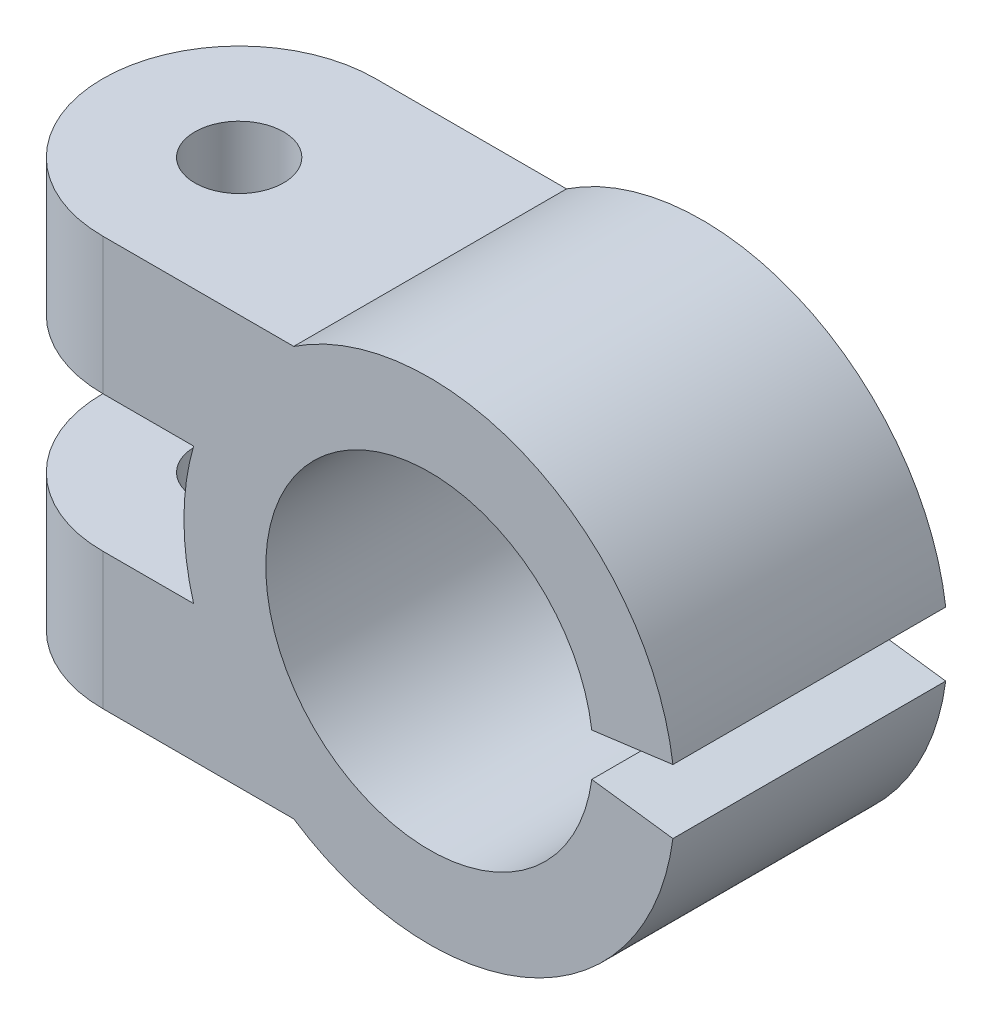
ISO-10303-21;
HEADER;
FILE_DESCRIPTION(('STEP AP214'),'2;1');
FILE_NAME('part.step','',(''),(''),'','','');
FILE_SCHEMA(('AUTOMOTIVE_DESIGN { 1 0 10303 214 1 1 1 1 }'));
ENDSEC;
DATA;
#1=APPLICATION_CONTEXT('core data for automotive mechanical design processes');
#2=APPLICATION_PROTOCOL_DEFINITION('international standard','automotive_design',2000,#1);
#3=PRODUCT_CONTEXT('',#1,'mechanical');
#4=PRODUCT('Part','Part','',(#3));
#5=PRODUCT_RELATED_PRODUCT_CATEGORY('part','',(#4));
#6=PRODUCT_DEFINITION_FORMATION('','',#4);
#7=PRODUCT_DEFINITION_CONTEXT('part definition',#1,'design');
#8=PRODUCT_DEFINITION('design','',#6,#7);
#9=PRODUCT_DEFINITION_SHAPE('','',#8);
#10=(LENGTH_UNIT() NAMED_UNIT(*) SI_UNIT(.MILLI.,.METRE.));
#11=(NAMED_UNIT(*) PLANE_ANGLE_UNIT() SI_UNIT($,.RADIAN.));
#12=(NAMED_UNIT(*) SI_UNIT($,.STERADIAN.) SOLID_ANGLE_UNIT());
#13=UNCERTAINTY_MEASURE_WITH_UNIT(LENGTH_MEASURE(1.E-05),#10,'distance_accuracy_value','');
#14=(GEOMETRIC_REPRESENTATION_CONTEXT(3) GLOBAL_UNCERTAINTY_ASSIGNED_CONTEXT((#13)) GLOBAL_UNIT_ASSIGNED_CONTEXT((#10,
#11,#12)) REPRESENTATION_CONTEXT('',''));
#15=CARTESIAN_POINT('',(0.,0.,0.));
#16=DIRECTION('',(0.,0.,1.));
#17=DIRECTION('',(1.,0.,0.));
#18=AXIS2_PLACEMENT_3D('',#15,#16,#17);
#19=CARTESIAN_POINT('',(-11.9749371855331,9.,5.));
#20=DIRECTION('',(0.,-1.,0.));
#21=DIRECTION('',(1.,0.,0.));
#22=AXIS2_PLACEMENT_3D('',#19,#20,#21);
#23=CYLINDRICAL_SURFACE('',#22,1.625);
#24=CARTESIAN_POINT('',(-11.9749371855331,-2.5,5.));
#25=DIRECTION('',(0.,-1.,0.));
#26=DIRECTION('',(1.,0.,0.));
#27=AXIS2_PLACEMENT_3D('',#24,#25,#26);
#28=CIRCLE('',#27,1.625);
#29=CARTESIAN_POINT('',(-10.3499371855331,-2.5,5.));
#30=VERTEX_POINT('',#29);
#31=EDGE_CURVE('E268',#30,#30,#28,.F.);
#32=ORIENTED_EDGE('',*,*,#31,.T.);
#33=EDGE_LOOP('',(#32));
#34=FACE_BOUND('',#33,.T.);
#35=CARTESIAN_POINT('',(-11.9749371855331,-5.2,5.));
#36=DIRECTION('',(0.,-1.,0.));
#37=DIRECTION('',(0.,0.,-1.));
#38=AXIS2_PLACEMENT_3D('',#35,#36,#37);
#39=CIRCLE('',#38,1.625);
#40=CARTESIAN_POINT('',(-11.9749371855331,-5.2,3.375));
#41=VERTEX_POINT('',#40);
#42=EDGE_CURVE('E36',#41,#41,#39,.F.);
#43=ORIENTED_EDGE('',*,*,#42,.F.);
#44=EDGE_LOOP('',(#43));
#45=FACE_BOUND('',#44,.T.);
#46=ADVANCED_FACE('F32',(#34,#45),#23,.F.);
#47=CARTESIAN_POINT('',(0.,0.,0.));
#48=DIRECTION('',(0.,0.,1.));
#49=DIRECTION('',(1.,0.,0.));
#50=AXIS2_PLACEMENT_3D('',#47,#48,#49);
#51=CYLINDRICAL_SURFACE('',#50,9.);
#52=DIRECTION('',(0.,0.,1.));
#53=VECTOR('',#52,1.);
#54=CARTESIAN_POINT('',(-8.64580823289529,-2.5,0.));
#55=LINE('',#54,#53);
#56=CARTESIAN_POINT('',(-8.64580823289529,-2.5,0.));
#57=VERTEX_POINT('',#56);
#58=CARTESIAN_POINT('',(-8.64580823289529,-2.5,0.621998125090777));
#59=VERTEX_POINT('',#58);
#60=EDGE_CURVE('E256',#57,#59,#55,.T.);
#61=ORIENTED_EDGE('',*,*,#60,.T.);
#62=CARTESIAN_POINT('',(-8.64580823289529,-2.5,0.621998125090777));
#63=CARTESIAN_POINT('',(-8.67828126991192,-2.38771961929906,0.597318032627893));
#64=CARTESIAN_POINT('',(-8.70867702053455,-2.27438318593473,0.574761575041442));
#65=CARTESIAN_POINT('',(-8.7651540966611,-2.04594389616501,0.533620812518907));
#66=CARTESIAN_POINT('',(-8.79123601155127,-1.9308412834195,0.515035964852341));
#67=CARTESIAN_POINT('',(-8.83892333773925,-1.69923878673797,0.481564563287811));
#68=CARTESIAN_POINT('',(-8.8605308440495,-1.58273958386935,0.466676277928622));
#69=CARTESIAN_POINT('',(-8.89917693862374,-1.3486047279511,0.440368338495543));
#70=CARTESIAN_POINT('',(-8.91621540136065,-1.23096904377044,0.428948779718157));
#71=CARTESIAN_POINT('',(-8.95942317453489,-0.884197201140675,0.400229112206679));
#72=CARTESIAN_POINT('',(-8.97919343570807,-0.65384365693981,0.387441823289321));
#73=CARTESIAN_POINT('',(-9.00092271419665,-0.191983296734021,0.373403086047597));
#74=CARTESIAN_POINT('',(-9.00288204570967,0.0395234988546319,0.372151434226273));
#75=CARTESIAN_POINT('',(-8.99029346010361,0.458014703977985,0.380267757993741));
#76=CARTESIAN_POINT('',(-8.97879867269678,0.645135321875428,0.387671243383126));
#77=CARTESIAN_POINT('',(-8.94422422859518,1.01776878967844,0.410314772750872));
#78=CARTESIAN_POINT('',(-8.92114837491746,1.20328214704967,0.425552244227041));
#79=CARTESIAN_POINT('',(-8.86291201950286,1.57650537074293,0.464961538287904));
#80=CARTESIAN_POINT('',(-8.8274511891554,1.76414575210169,0.489356645384948));
#81=CARTESIAN_POINT('',(-8.76567120377647,2.04256386354546,0.53331862036557));
#82=CARTESIAN_POINT('',(-8.74363514381309,2.13490170018891,0.549209213692224));
#83=CARTESIAN_POINT('',(-8.69678428913928,2.31838584986829,0.583604287340637));
#84=CARTESIAN_POINT('',(-8.67196925681976,2.409532060272,0.602108991210794));
#85=CARTESIAN_POINT('',(-8.64580823289529,2.5,0.621998125090779));
#86=B_SPLINE_CURVE_WITH_KNOTS('',3,(#62,#63,#64,#65,#66,#67,#68,#69,#70,#71,#72,#73,#74,#75,#76,
#77,#78,#79,#80,#81,#82,#83,#84,#85),.UNSPECIFIED.,.F.,.F.,(4,2,2,2,2,2,2,2,2,2,2,4),(0.,
0.358319681642908,0.716590366644925,1.07469292055495,1.43280531174513,2.12639692959824,
2.81997631197154,3.38232626265192,3.94449166828021,4.52136260131052,4.81004533632213,
5.09875277330095),.UNSPECIFIED.);
#87=CARTESIAN_POINT('',(-8.64580823289529,2.5,0.621998125090777));
#88=VERTEX_POINT('',#87);
#89=EDGE_CURVE('E11',#59,#88,#86,.T.);
#90=ORIENTED_EDGE('',*,*,#89,.T.);
#91=DIRECTION('',(0.,0.,1.));
#92=VECTOR('',#91,1.);
#93=CARTESIAN_POINT('',(-8.64580823289529,2.5,0.));
#94=LINE('',#93,#92);
#95=CARTESIAN_POINT('',(-8.64580823289529,2.5,0.));
#96=VERTEX_POINT('',#95);
#97=EDGE_CURVE('E261',#96,#88,#94,.T.);
#98=ORIENTED_EDGE('',*,*,#97,.F.);
#99=CARTESIAN_POINT('',(0.,0.,0.));
#100=DIRECTION('',(0.,0.,-1.));
#101=DIRECTION('',(1.,0.,0.));
#102=AXIS2_PLACEMENT_3D('',#99,#100,#101);
#103=CIRCLE('',#102,9.);
#104=EDGE_CURVE('E242',#57,#96,#103,.T.);
#105=ORIENTED_EDGE('',*,*,#104,.F.);
#106=EDGE_LOOP('',(#61,#90,#98,#105));
#107=FACE_BOUND('',#106,.T.);
#108=ADVANCED_FACE('F381',(#107),#51,.T.);
#109=CARTESIAN_POINT('',(-11.9749371855331,0.,5.));
#110=DIRECTION('',(0.,-1.,0.));
#111=DIRECTION('',(1.,0.,0.));
#112=AXIS2_PLACEMENT_3D('',#109,#110,#111);
#113=CYLINDRICAL_SURFACE('',#112,5.);
#114=CARTESIAN_POINT('',(-11.9749371855331,-2.5,5.));
#115=DIRECTION('',(0.,-1.,0.));
#116=DIRECTION('',(1.,0.,0.));
#117=AXIS2_PLACEMENT_3D('',#114,#115,#116);
#118=CIRCLE('',#117,5.);
#119=CARTESIAN_POINT('',(-16.9749371855331,-2.5,4.99999999999999));
#120=VERTEX_POINT('',#119);
#121=CARTESIAN_POINT('',(-11.9749371855331,-2.5,10.));
#122=VERTEX_POINT('',#121);
#123=EDGE_CURVE('E271',#120,#122,#118,.F.);
#124=ORIENTED_EDGE('',*,*,#123,.F.);
#125=DIRECTION('',(0.,-1.,0.));
#126=VECTOR('',#125,1.);
#127=CARTESIAN_POINT('',(-16.9749371855331,7.5,5.));
#128=LINE('',#127,#126);
#129=CARTESIAN_POINT('',(-16.9749371855331,-7.5,4.99999999999999));
#130=VERTEX_POINT('',#129);
#131=EDGE_CURVE('E283',#130,#120,#128,.F.);
#132=ORIENTED_EDGE('',*,*,#131,.F.);
#133=CARTESIAN_POINT('',(-11.9749371855331,-7.5,5.));
#134=DIRECTION('',(0.,-1.,0.));
#135=DIRECTION('',(1.,0.,0.));
#136=AXIS2_PLACEMENT_3D('',#133,#134,#135);
#137=CIRCLE('',#136,5.);
#138=CARTESIAN_POINT('',(-11.9749371855331,-7.5,10.));
#139=VERTEX_POINT('',#138);
#140=EDGE_CURVE('E333',#139,#130,#137,.T.);
#141=ORIENTED_EDGE('',*,*,#140,.F.);
#142=DIRECTION('',(0.,-1.,0.));
#143=VECTOR('',#142,1.);
#144=CARTESIAN_POINT('',(-11.9749371855331,0.,10.));
#145=LINE('',#144,#143);
#146=EDGE_CURVE('E337',#122,#139,#145,.T.);
#147=ORIENTED_EDGE('',*,*,#146,.F.);
#148=EDGE_LOOP('',(#124,#132,#141,#147));
#149=FACE_BOUND('',#148,.T.);
#150=ADVANCED_FACE('F388',(#149),#113,.T.);
#151=CARTESIAN_POINT('',(-11.9749371855331,0.,5.));
#152=DIRECTION('',(0.,-1.,0.));
#153=DIRECTION('',(1.,0.,0.));
#154=AXIS2_PLACEMENT_3D('',#151,#152,#153);
#155=CYLINDRICAL_SURFACE('',#154,5.);
#156=CARTESIAN_POINT('',(-11.9749371855331,-2.5,5.));
#157=DIRECTION('',(0.,-1.,0.));
#158=DIRECTION('',(1.,0.,0.));
#159=AXIS2_PLACEMENT_3D('',#156,#157,#158);
#160=CIRCLE('',#159,5.);
#161=CARTESIAN_POINT('',(-11.9749371855331,-2.5,0.));
#162=VERTEX_POINT('',#161);
#163=EDGE_CURVE('E269',#162,#120,#160,.F.);
#164=ORIENTED_EDGE('',*,*,#163,.F.);
#165=DIRECTION('',(0.,1.,0.));
#166=VECTOR('',#165,1.);
#167=CARTESIAN_POINT('',(-11.9749371855331,7.5,0.));
#168=LINE('',#167,#166);
#169=CARTESIAN_POINT('',(-11.9749371855331,-7.5,0.));
#170=VERTEX_POINT('',#169);
#171=EDGE_CURVE('E325',#170,#162,#168,.T.);
#172=ORIENTED_EDGE('',*,*,#171,.F.);
#173=CARTESIAN_POINT('',(-11.9749371855331,-7.5,5.));
#174=DIRECTION('',(0.,-1.,0.));
#175=DIRECTION('',(1.,0.,0.));
#176=AXIS2_PLACEMENT_3D('',#173,#174,#175);
#177=CIRCLE('',#176,5.);
#178=EDGE_CURVE('E335',#130,#170,#177,.T.);
#179=ORIENTED_EDGE('',*,*,#178,.F.);
#180=ORIENTED_EDGE('',*,*,#131,.T.);
#181=EDGE_LOOP('',(#164,#172,#179,#180));
#182=FACE_BOUND('',#181,.T.);
#183=ADVANCED_FACE('F399',(#182),#155,.T.);
#184=CARTESIAN_POINT('',(0.,0.,10.));
#185=DIRECTION('',(0.,0.,-1.));
#186=DIRECTION('',(-1.,0.,0.));
#187=AXIS2_PLACEMENT_3D('',#184,#185,#186);
#188=CYLINDRICAL_SURFACE('',#187,9.);
#189=CARTESIAN_POINT('',(0.,0.,10.));
#190=DIRECTION('',(0.,0.,1.));
#191=DIRECTION('',(1.,0.,0.));
#192=AXIS2_PLACEMENT_3D('',#189,#190,#191);
#193=CIRCLE('',#192,9.);
#194=CARTESIAN_POINT('',(-4.97493718553311,-7.5,10.));
#195=VERTEX_POINT('',#194);
#196=CARTESIAN_POINT('',(8.92300375236431,-1.1747357299804,10.));
#197=VERTEX_POINT('',#196);
#198=EDGE_CURVE('E317',#195,#197,#193,.T.);
#199=ORIENTED_EDGE('',*,*,#198,.F.);
#200=DIRECTION('',(0.,0.,1.));
#201=VECTOR('',#200,1.);
#202=CARTESIAN_POINT('',(-4.97493718553311,-7.5,-19.2093727122985));
#203=LINE('',#202,#201);
#204=CARTESIAN_POINT('',(-4.97493718553311,-7.5,0.));
#205=VERTEX_POINT('',#204);
#206=EDGE_CURVE('E278',#205,#195,#203,.T.);
#207=ORIENTED_EDGE('',*,*,#206,.F.);
#208=CARTESIAN_POINT('',(0.,0.,0.));
#209=DIRECTION('',(0.,0.,1.));
#210=DIRECTION('',(1.,0.,0.));
#211=AXIS2_PLACEMENT_3D('',#208,#209,#210);
#212=CIRCLE('',#211,9.);
#213=CARTESIAN_POINT('',(8.92300375236431,-1.1747357299804,0.));
#214=VERTEX_POINT('',#213);
#215=EDGE_CURVE('E310',#205,#214,#212,.T.);
#216=ORIENTED_EDGE('',*,*,#215,.T.);
#217=DIRECTION('',(0.,0.,1.));
#218=VECTOR('',#217,1.);
#219=CARTESIAN_POINT('',(8.92300375236431,-1.1747357299804,0.));
#220=LINE('',#219,#218);
#221=EDGE_CURVE('E298',#214,#197,#220,.T.);
#222=ORIENTED_EDGE('',*,*,#221,.T.);
#223=EDGE_LOOP('',(#199,#207,#216,#222));
#224=FACE_BOUND('',#223,.T.);
#225=ADVANCED_FACE('F441',(#224),#188,.T.);
#226=CARTESIAN_POINT('',(0.,0.,10.));
#227=DIRECTION('',(0.,0.,1.));
#228=DIRECTION('',(1.,0.,0.));
#229=AXIS2_PLACEMENT_3D('',#226,#227,#228);
#230=PLANE('',#229);
#231=DIRECTION('',(1.,0.,0.));
#232=VECTOR('',#231,1.);
#233=CARTESIAN_POINT('',(-8.64580823289529,-2.5,10.));
#234=LINE('',#233,#232);
#235=CARTESIAN_POINT('',(-8.64580823289529,-2.5,10.));
#236=VERTEX_POINT('',#235);
#237=EDGE_CURVE('E246',#122,#236,#234,.T.);
#238=ORIENTED_EDGE('',*,*,#237,.F.);
#239=ORIENTED_EDGE('',*,*,#146,.T.);
#240=DIRECTION('',(1.,0.,0.));
#241=VECTOR('',#240,1.);
#242=CARTESIAN_POINT('',(-4.97493718553311,-7.5,10.));
#243=LINE('',#242,#241);
#244=EDGE_CURVE('E282',#139,#195,#243,.T.);
#245=ORIENTED_EDGE('',*,*,#244,.T.);
#246=ORIENTED_EDGE('',*,*,#198,.T.);
#247=DIRECTION('',(0.991444861373811,-0.130526192220044,0.));
#248=VECTOR('',#247,1.);
#249=CARTESIAN_POINT('',(8.92300375236431,-1.1747357299804,10.));
#250=LINE('',#249,#248);
#251=CARTESIAN_POINT('',(5.94866916824287,-0.783157153320264,10.));
#252=VERTEX_POINT('',#251);
#253=EDGE_CURVE('E290',#252,#197,#250,.T.);
#254=ORIENTED_EDGE('',*,*,#253,.F.);
#255=CARTESIAN_POINT('',(0.,0.,10.));
#256=DIRECTION('',(0.,0.,1.));
#257=DIRECTION('',(1.,0.,0.));
#258=AXIS2_PLACEMENT_3D('',#255,#256,#257);
#259=CIRCLE('',#258,6.);
#260=CARTESIAN_POINT('',(5.94866916824286,0.783157153320315,10.));
#261=VERTEX_POINT('',#260);
#262=EDGE_CURVE('E307',#261,#252,#259,.T.);
#263=ORIENTED_EDGE('',*,*,#262,.F.);
#264=DIRECTION('',(-0.99144486137381,-0.130526192220053,0.));
#265=VECTOR('',#264,1.);
#266=CARTESIAN_POINT('',(0.,0.,10.));
#267=LINE('',#266,#265);
#268=CARTESIAN_POINT('',(8.92300375236429,1.17473572998047,10.));
#269=VERTEX_POINT('',#268);
#270=EDGE_CURVE('E295',#269,#261,#267,.T.);
#271=ORIENTED_EDGE('',*,*,#270,.F.);
#272=CARTESIAN_POINT('',(-4.9749371855331,7.5,10.));
#273=VERTEX_POINT('',#272);
#274=EDGE_CURVE('E313',#269,#273,#193,.T.);
#275=ORIENTED_EDGE('',*,*,#274,.T.);
#276=DIRECTION('',(-1.,0.,0.));
#277=VECTOR('',#276,1.);
#278=CARTESIAN_POINT('',(-4.97493718553311,7.5,10.));
#279=LINE('',#278,#277);
#280=CARTESIAN_POINT('',(-11.9749371855331,7.5,10.));
#281=VERTEX_POINT('',#280);
#282=EDGE_CURVE('E279',#273,#281,#279,.T.);
#283=ORIENTED_EDGE('',*,*,#282,.T.);
#284=CARTESIAN_POINT('',(-11.9749371855331,2.5,10.));
#285=VERTEX_POINT('',#284);
#286=EDGE_CURVE('E338',#281,#285,#145,.T.);
#287=ORIENTED_EDGE('',*,*,#286,.T.);
#288=DIRECTION('',(-1.,0.,0.));
#289=VECTOR('',#288,1.);
#290=CARTESIAN_POINT('',(-8.64580823289529,2.5,10.));
#291=LINE('',#290,#289);
#292=CARTESIAN_POINT('',(-8.64580823289529,2.5,10.));
#293=VERTEX_POINT('',#292);
#294=EDGE_CURVE('E253',#293,#285,#291,.T.);
#295=ORIENTED_EDGE('',*,*,#294,.F.);
#296=CARTESIAN_POINT('',(0.,0.,10.));
#297=DIRECTION('',(0.,0.,-1.));
#298=DIRECTION('',(1.,0.,0.));
#299=AXIS2_PLACEMENT_3D('',#296,#297,#298);
#300=CIRCLE('',#299,9.);
#301=EDGE_CURVE('E240',#236,#293,#300,.T.);
#302=ORIENTED_EDGE('',*,*,#301,.F.);
#303=EDGE_LOOP('',(#238,#239,#245,#246,#254,#263,#271,#275,#283,#287,#295,#302));
#304=FACE_BOUND('',#303,.T.);
#305=ADVANCED_FACE('F429',(#304),#230,.T.);
#306=CARTESIAN_POINT('',(0.,0.,0.));
#307=DIRECTION('',(0.,0.,1.));
#308=DIRECTION('',(1.,0.,0.));
#309=AXIS2_PLACEMENT_3D('',#306,#307,#308);
#310=PLANE('',#309);
#311=ORIENTED_EDGE('',*,*,#171,.T.);
#312=DIRECTION('',(1.,0.,0.));
#313=VECTOR('',#312,1.);
#314=CARTESIAN_POINT('',(-8.64580823289529,-2.5,0.));
#315=LINE('',#314,#313);
#316=EDGE_CURVE('E248',#162,#57,#315,.T.);
#317=ORIENTED_EDGE('',*,*,#316,.T.);
#318=ORIENTED_EDGE('',*,*,#104,.T.);
#319=DIRECTION('',(-1.,0.,0.));
#320=VECTOR('',#319,1.);
#321=CARTESIAN_POINT('',(-8.64580823289529,2.5,0.));
#322=LINE('',#321,#320);
#323=CARTESIAN_POINT('',(-11.9749371855331,2.5,0.));
#324=VERTEX_POINT('',#323);
#325=EDGE_CURVE('E245',#96,#324,#322,.T.);
#326=ORIENTED_EDGE('',*,*,#325,.T.);
#327=CARTESIAN_POINT('',(-11.9749371855331,7.5,0.));
#328=VERTEX_POINT('',#327);
#329=EDGE_CURVE('E324',#324,#328,#168,.T.);
#330=ORIENTED_EDGE('',*,*,#329,.T.);
#331=DIRECTION('',(1.,0.,0.));
#332=VECTOR('',#331,1.);
#333=CARTESIAN_POINT('',(-4.97493718553311,7.5,0.));
#334=LINE('',#333,#332);
#335=CARTESIAN_POINT('',(-4.9749371855331,7.5,0.));
#336=VERTEX_POINT('',#335);
#337=EDGE_CURVE('E277',#328,#336,#334,.T.);
#338=ORIENTED_EDGE('',*,*,#337,.T.);
#339=CARTESIAN_POINT('',(8.92300375236429,1.17473572998047,0.));
#340=VERTEX_POINT('',#339);
#341=EDGE_CURVE('E318',#340,#336,#212,.T.);
#342=ORIENTED_EDGE('',*,*,#341,.F.);
#343=DIRECTION('',(-0.99144486137381,-0.130526192220053,0.));
#344=VECTOR('',#343,1.);
#345=CARTESIAN_POINT('',(0.,0.,0.));
#346=LINE('',#345,#344);
#347=CARTESIAN_POINT('',(5.94866916824286,0.783157153320315,0.));
#348=VERTEX_POINT('',#347);
#349=EDGE_CURVE('E294',#340,#348,#346,.T.);
#350=ORIENTED_EDGE('',*,*,#349,.T.);
#351=CARTESIAN_POINT('',(0.,0.,0.));
#352=DIRECTION('',(0.,0.,1.));
#353=DIRECTION('',(1.,0.,0.));
#354=AXIS2_PLACEMENT_3D('',#351,#352,#353);
#355=CIRCLE('',#354,6.);
#356=CARTESIAN_POINT('',(5.94866916824287,-0.783157153320264,0.));
#357=VERTEX_POINT('',#356);
#358=EDGE_CURVE('E304',#348,#357,#355,.T.);
#359=ORIENTED_EDGE('',*,*,#358,.T.);
#360=DIRECTION('',(0.991444861373811,-0.130526192220044,0.));
#361=VECTOR('',#360,1.);
#362=CARTESIAN_POINT('',(8.92300375236431,-1.1747357299804,0.));
#363=LINE('',#362,#361);
#364=EDGE_CURVE('E291',#357,#214,#363,.T.);
#365=ORIENTED_EDGE('',*,*,#364,.T.);
#366=ORIENTED_EDGE('',*,*,#215,.F.);
#367=DIRECTION('',(-1.,0.,0.));
#368=VECTOR('',#367,1.);
#369=CARTESIAN_POINT('',(-4.97493718553311,-7.5,0.));
#370=LINE('',#369,#368);
#371=EDGE_CURVE('E274',#205,#170,#370,.T.);
#372=ORIENTED_EDGE('',*,*,#371,.T.);
#373=EDGE_LOOP('',(#311,#317,#318,#326,#330,#338,#342,#350,#359,#365,#366,#372));
#374=FACE_BOUND('',#373,.T.);
#375=ADVANCED_FACE('F416',(#374),#310,.F.);
#376=ORIENTED_EDGE('',*,*,#341,.T.);
#377=DIRECTION('',(0.,0.,1.));
#378=VECTOR('',#377,1.);
#379=CARTESIAN_POINT('',(-4.97493718553311,7.5,-19.2093727122985));
#380=LINE('',#379,#378);
#381=EDGE_CURVE('E285',#336,#273,#380,.T.);
#382=ORIENTED_EDGE('',*,*,#381,.T.);
#383=ORIENTED_EDGE('',*,*,#274,.F.);
#384=DIRECTION('',(0.,0.,1.));
#385=VECTOR('',#384,1.);
#386=CARTESIAN_POINT('',(8.92300375236429,1.17473572998047,0.));
#387=LINE('',#386,#385);
#388=EDGE_CURVE('E302',#340,#269,#387,.T.);
#389=ORIENTED_EDGE('',*,*,#388,.F.);
#390=EDGE_LOOP('',(#376,#382,#383,#389));
#391=FACE_BOUND('',#390,.T.);
#392=ADVANCED_FACE('F420',(#391),#188,.T.);
#393=CARTESIAN_POINT('',(0.,0.,10.));
#394=DIRECTION('',(0.,0.,-1.));
#395=DIRECTION('',(-1.,0.,0.));
#396=AXIS2_PLACEMENT_3D('',#393,#394,#395);
#397=CYLINDRICAL_SURFACE('',#396,6.);
#398=DIRECTION('',(0.,0.,-1.));
#399=VECTOR('',#398,1.);
#400=CARTESIAN_POINT('',(5.94866916824287,-0.783157153320264,10.));
#401=LINE('',#400,#399);
#402=EDGE_CURVE('E322',#357,#252,#401,.F.);
#403=ORIENTED_EDGE('',*,*,#402,.F.);
#404=ORIENTED_EDGE('',*,*,#358,.F.);
#405=DIRECTION('',(0.,0.,-1.));
#406=VECTOR('',#405,1.);
#407=CARTESIAN_POINT('',(5.94866916824286,0.783157153320316,10.));
#408=LINE('',#407,#406);
#409=EDGE_CURVE('E316',#261,#348,#408,.T.);
#410=ORIENTED_EDGE('',*,*,#409,.F.);
#411=ORIENTED_EDGE('',*,*,#262,.T.);
#412=EDGE_LOOP('',(#403,#404,#410,#411));
#413=FACE_BOUND('',#412,.T.);
#414=ADVANCED_FACE('F433',(#413),#397,.F.);
#415=CARTESIAN_POINT('',(0.,0.,0.));
#416=DIRECTION('',(-0.130526192220053,0.99144486137381,0.));
#417=DIRECTION('',(-0.99144486137381,-0.130526192220053,0.));
#418=AXIS2_PLACEMENT_3D('',#415,#416,#417);
#419=PLANE('',#418);
#420=ORIENTED_EDGE('',*,*,#409,.T.);
#421=ORIENTED_EDGE('',*,*,#349,.F.);
#422=ORIENTED_EDGE('',*,*,#388,.T.);
#423=ORIENTED_EDGE('',*,*,#270,.T.);
#424=EDGE_LOOP('',(#420,#421,#422,#423));
#425=FACE_BOUND('',#424,.T.);
#426=ADVANCED_FACE('F424',(#425),#419,.F.);
#427=CARTESIAN_POINT('',(8.92300375236431,-1.1747357299804,0.));
#428=DIRECTION('',(-0.130526192220044,-0.991444861373811,0.));
#429=DIRECTION('',(0.991444861373811,-0.130526192220044,0.));
#430=AXIS2_PLACEMENT_3D('',#427,#428,#429);
#431=PLANE('',#430);
#432=ORIENTED_EDGE('',*,*,#402,.T.);
#433=ORIENTED_EDGE('',*,*,#253,.T.);
#434=ORIENTED_EDGE('',*,*,#221,.F.);
#435=ORIENTED_EDGE('',*,*,#364,.F.);
#436=EDGE_LOOP('',(#432,#433,#434,#435));
#437=FACE_BOUND('',#436,.T.);
#438=ADVANCED_FACE('F438',(#437),#431,.F.);
#439=CARTESIAN_POINT('',(-4.97493718553311,-7.5,-19.2093727122985));
#440=DIRECTION('',(0.,-1.,0.));
#441=DIRECTION('',(1.,0.,0.));
#442=AXIS2_PLACEMENT_3D('',#439,#440,#441);
#443=PLANE('',#442);
#444=DIRECTION('',(0.5,0.,0.866025403784439));
#445=VECTOR('',#444,1.);
#446=CARTESIAN_POINT('',(-10.3872239452616,-7.5,2.25));
#447=LINE('',#446,#445);
#448=CARTESIAN_POINT('',(-10.3872239452616,-7.5,2.25));
#449=VERTEX_POINT('',#448);
#450=CARTESIAN_POINT('',(-8.79951070499016,-7.5,5.));
#451=VERTEX_POINT('',#450);
#452=EDGE_CURVE('E48',#449,#451,#447,.T.);
#453=ORIENTED_EDGE('',*,*,#452,.F.);
#454=DIRECTION('',(1.,0.,0.));
#455=VECTOR('',#454,1.);
#456=CARTESIAN_POINT('',(-13.5626504258046,-7.5,2.25));
#457=LINE('',#456,#455);
#458=CARTESIAN_POINT('',(-13.5626504258046,-7.5,2.25));
#459=VERTEX_POINT('',#458);
#460=EDGE_CURVE('E204',#459,#449,#457,.T.);
#461=ORIENTED_EDGE('',*,*,#460,.F.);
#462=DIRECTION('',(0.5,0.,-0.866025403784439));
#463=VECTOR('',#462,1.);
#464=CARTESIAN_POINT('',(-15.150363666076,-7.5,5.));
#465=LINE('',#464,#463);
#466=CARTESIAN_POINT('',(-15.150363666076,-7.5,5.));
#467=VERTEX_POINT('',#466);
#468=EDGE_CURVE('E207',#467,#459,#465,.T.);
#469=ORIENTED_EDGE('',*,*,#468,.F.);
#470=DIRECTION('',(-0.5,0.,-0.866025403784439));
#471=VECTOR('',#470,1.);
#472=CARTESIAN_POINT('',(-13.5626504258046,-7.5,7.75));
#473=LINE('',#472,#471);
#474=CARTESIAN_POINT('',(-13.5626504258046,-7.5,7.75));
#475=VERTEX_POINT('',#474);
#476=EDGE_CURVE('E223',#475,#467,#473,.T.);
#477=ORIENTED_EDGE('',*,*,#476,.F.);
#478=DIRECTION('',(-1.,0.,0.));
#479=VECTOR('',#478,1.);
#480=CARTESIAN_POINT('',(-10.3872239452616,-7.5,7.75));
#481=LINE('',#480,#479);
#482=CARTESIAN_POINT('',(-10.3872239452616,-7.5,7.75));
#483=VERTEX_POINT('',#482);
#484=EDGE_CURVE('E220',#483,#475,#481,.T.);
#485=ORIENTED_EDGE('',*,*,#484,.F.);
#486=DIRECTION('',(-0.5,0.,0.866025403784438));
#487=VECTOR('',#486,1.);
#488=CARTESIAN_POINT('',(-8.79951070499016,-7.5,5.));
#489=LINE('',#488,#487);
#490=EDGE_CURVE('E218',#451,#483,#489,.T.);
#491=ORIENTED_EDGE('',*,*,#490,.F.);
#492=EDGE_LOOP('',(#453,#461,#469,#477,#485,#491));
#493=FACE_BOUND('',#492,.T.);
#494=ORIENTED_EDGE('',*,*,#140,.T.);
#495=ORIENTED_EDGE('',*,*,#178,.T.);
#496=ORIENTED_EDGE('',*,*,#371,.F.);
#497=ORIENTED_EDGE('',*,*,#206,.T.);
#498=ORIENTED_EDGE('',*,*,#244,.F.);
#499=EDGE_LOOP('',(#494,#495,#496,#497,#498));
#500=FACE_BOUND('',#499,.T.);
#501=ADVANCED_FACE('F407',(#493,#500),#443,.T.);
#502=CARTESIAN_POINT('',(-4.97493718553311,7.5,-19.2093727122985));
#503=DIRECTION('',(0.,1.,0.));
#504=DIRECTION('',(-1.,0.,0.));
#505=AXIS2_PLACEMENT_3D('',#502,#503,#504);
#506=PLANE('',#505);
#507=CARTESIAN_POINT('',(-11.9749371855331,7.5,5.));
#508=DIRECTION('',(0.,1.,0.));
#509=DIRECTION('',(-1.,0.,0.));
#510=AXIS2_PLACEMENT_3D('',#507,#508,#509);
#511=CIRCLE('',#510,1.625);
#512=CARTESIAN_POINT('',(-13.5999371855331,7.5,5.));
#513=VERTEX_POINT('',#512);
#514=EDGE_CURVE('E273',#513,#513,#511,.T.);
#515=ORIENTED_EDGE('',*,*,#514,.F.);
#516=EDGE_LOOP('',(#515));
#517=FACE_BOUND('',#516,.T.);
#518=ORIENTED_EDGE('',*,*,#337,.F.);
#519=CARTESIAN_POINT('',(-11.9749371855331,7.5,5.));
#520=DIRECTION('',(0.,1.,0.));
#521=DIRECTION('',(-1.,0.,0.));
#522=AXIS2_PLACEMENT_3D('',#519,#520,#521);
#523=CIRCLE('',#522,5.);
#524=CARTESIAN_POINT('',(-16.9749371855331,7.5,4.99999999999999));
#525=VERTEX_POINT('',#524);
#526=EDGE_CURVE('E330',#328,#525,#523,.T.);
#527=ORIENTED_EDGE('',*,*,#526,.T.);
#528=CARTESIAN_POINT('',(-11.9749371855331,7.5,5.));
#529=DIRECTION('',(0.,1.,0.));
#530=DIRECTION('',(-1.,0.,0.));
#531=AXIS2_PLACEMENT_3D('',#528,#529,#530);
#532=CIRCLE('',#531,5.);
#533=EDGE_CURVE('E328',#525,#281,#532,.T.);
#534=ORIENTED_EDGE('',*,*,#533,.T.);
#535=ORIENTED_EDGE('',*,*,#282,.F.);
#536=ORIENTED_EDGE('',*,*,#381,.F.);
#537=EDGE_LOOP('',(#518,#527,#534,#535,#536));
#538=FACE_BOUND('',#537,.T.);
#539=ADVANCED_FACE('F404',(#517,#538),#506,.T.);
#540=CARTESIAN_POINT('',(-11.9749371855331,2.5,5.));
#541=DIRECTION('',(0.,1.,0.));
#542=DIRECTION('',(-1.,0.,0.));
#543=AXIS2_PLACEMENT_3D('',#540,#541,#542);
#544=CIRCLE('',#543,5.);
#545=CARTESIAN_POINT('',(-16.9749371855331,2.5,5.));
#546=VERTEX_POINT('',#545);
#547=EDGE_CURVE('E266',#285,#546,#544,.F.);
#548=ORIENTED_EDGE('',*,*,#547,.F.);
#549=ORIENTED_EDGE('',*,*,#286,.F.);
#550=ORIENTED_EDGE('',*,*,#533,.F.);
#551=EDGE_CURVE('E343',#546,#525,#128,.F.);
#552=ORIENTED_EDGE('',*,*,#551,.F.);
#553=EDGE_LOOP('',(#548,#549,#550,#552));
#554=FACE_BOUND('',#553,.T.);
#555=ADVANCED_FACE('F34',(#554),#113,.T.);
#556=CARTESIAN_POINT('',(-11.9749371855331,2.5,5.));
#557=DIRECTION('',(0.,1.,0.));
#558=DIRECTION('',(-1.,0.,0.));
#559=AXIS2_PLACEMENT_3D('',#556,#557,#558);
#560=CIRCLE('',#559,5.);
#561=EDGE_CURVE('E263',#546,#324,#560,.F.);
#562=ORIENTED_EDGE('',*,*,#561,.F.);
#563=ORIENTED_EDGE('',*,*,#551,.T.);
#564=ORIENTED_EDGE('',*,*,#526,.F.);
#565=ORIENTED_EDGE('',*,*,#329,.F.);
#566=EDGE_LOOP('',(#562,#563,#564,#565));
#567=FACE_BOUND('',#566,.T.);
#568=ADVANCED_FACE('F393',(#567),#155,.T.);
#569=CARTESIAN_POINT('',(-11.9749371855331,2.5,5.));
#570=DIRECTION('',(0.,1.,0.));
#571=DIRECTION('',(-1.,0.,0.));
#572=AXIS2_PLACEMENT_3D('',#569,#570,#571);
#573=CIRCLE('',#572,1.625);
#574=CARTESIAN_POINT('',(-13.5999371855331,2.5,5.));
#575=VERTEX_POINT('',#574);
#576=EDGE_CURVE('E259',#575,#575,#573,.F.);
#577=ORIENTED_EDGE('',*,*,#576,.T.);
#578=EDGE_LOOP('',(#577));
#579=FACE_BOUND('',#578,.T.);
#580=ORIENTED_EDGE('',*,*,#514,.T.);
#581=EDGE_LOOP('',(#580));
#582=FACE_BOUND('',#581,.T.);
#583=ADVANCED_FACE('F374',(#579,#582),#23,.F.);
#584=CARTESIAN_POINT('',(-8.64580823289529,-2.5,0.));
#585=DIRECTION('',(0.,-1.,0.));
#586=DIRECTION('',(1.,0.,0.));
#587=AXIS2_PLACEMENT_3D('',#584,#585,#586);
#588=PLANE('',#587);
#589=ORIENTED_EDGE('',*,*,#60,.F.);
#590=ORIENTED_EDGE('',*,*,#316,.F.);
#591=ORIENTED_EDGE('',*,*,#163,.T.);
#592=ORIENTED_EDGE('',*,*,#123,.T.);
#593=ORIENTED_EDGE('',*,*,#237,.T.);
#594=CARTESIAN_POINT('',(-8.64580823289529,-2.5,9.37800187490922));
#595=VERTEX_POINT('',#594);
#596=EDGE_CURVE('E260',#595,#236,#55,.T.);
#597=ORIENTED_EDGE('',*,*,#596,.F.);
#598=CARTESIAN_POINT('',(-11.9749371855331,-2.5,5.));
#599=DIRECTION('',(0.,1.,0.));
#600=DIRECTION('',(0.,0.,1.));
#601=AXIS2_PLACEMENT_3D('',#598,#599,#600);
#602=CIRCLE('',#601,5.5);
#603=EDGE_CURVE('E237',#595,#59,#602,.T.);
#604=ORIENTED_EDGE('',*,*,#603,.T.);
#605=EDGE_LOOP('',(#589,#590,#591,#592,#593,#597,#604));
#606=FACE_BOUND('',#605,.T.);
#607=ORIENTED_EDGE('',*,*,#31,.F.);
#608=EDGE_LOOP('',(#607));
#609=FACE_BOUND('',#608,.T.);
#610=ADVANCED_FACE('F370',(#606,#609),#588,.F.);
#611=CARTESIAN_POINT('',(-8.64580823289529,2.5,0.));
#612=DIRECTION('',(0.,1.,0.));
#613=DIRECTION('',(-1.,0.,0.));
#614=AXIS2_PLACEMENT_3D('',#611,#612,#613);
#615=PLANE('',#614);
#616=ORIENTED_EDGE('',*,*,#97,.T.);
#617=CARTESIAN_POINT('',(-11.9749371855331,2.5,5.));
#618=DIRECTION('',(0.,1.,0.));
#619=DIRECTION('',(0.,0.,1.));
#620=AXIS2_PLACEMENT_3D('',#617,#618,#619);
#621=CIRCLE('',#620,5.5);
#622=CARTESIAN_POINT('',(-8.64580823289529,2.5,9.37800187490922));
#623=VERTEX_POINT('',#622);
#624=EDGE_CURVE('E56',#623,#88,#621,.T.);
#625=ORIENTED_EDGE('',*,*,#624,.F.);
#626=EDGE_CURVE('E250',#623,#293,#94,.T.);
#627=ORIENTED_EDGE('',*,*,#626,.T.);
#628=ORIENTED_EDGE('',*,*,#294,.T.);
#629=ORIENTED_EDGE('',*,*,#547,.T.);
#630=ORIENTED_EDGE('',*,*,#561,.T.);
#631=ORIENTED_EDGE('',*,*,#325,.F.);
#632=EDGE_LOOP('',(#616,#625,#627,#628,#629,#630,#631));
#633=FACE_BOUND('',#632,.T.);
#634=ORIENTED_EDGE('',*,*,#576,.F.);
#635=EDGE_LOOP('',(#634));
#636=FACE_BOUND('',#635,.T.);
#637=ADVANCED_FACE('F373',(#633,#636),#615,.F.);
#638=ORIENTED_EDGE('',*,*,#626,.F.);
#639=CARTESIAN_POINT('',(-8.64580823289529,2.5,9.37800187490922));
#640=CARTESIAN_POINT('',(-8.67828126991192,2.38771961929906,9.40268196737211));
#641=CARTESIAN_POINT('',(-8.70867702053455,2.27438318593473,9.42523842495856));
#642=CARTESIAN_POINT('',(-8.7651540966611,2.04594389616501,9.46637918748109));
#643=CARTESIAN_POINT('',(-8.79123601155126,1.93084128341951,9.48496403514766));
#644=CARTESIAN_POINT('',(-8.83892333773925,1.69923878673797,9.51843543671219));
#645=CARTESIAN_POINT('',(-8.8605308440495,1.58273958386936,9.53332372207138));
#646=CARTESIAN_POINT('',(-8.89917693862374,1.3486047279511,9.55963166150446));
#647=CARTESIAN_POINT('',(-8.91621540136065,1.23096904377045,9.57105122028184));
#648=CARTESIAN_POINT('',(-8.95942317453488,0.884197201140677,9.59977088779332));
#649=CARTESIAN_POINT('',(-8.97919343570807,0.653843656939811,9.61255817671068));
#650=CARTESIAN_POINT('',(-9.00092271419665,0.191983296734022,9.6265969139524));
#651=CARTESIAN_POINT('',(-9.00288204570967,-0.0395234988546305,9.62784856577373));
#652=CARTESIAN_POINT('',(-8.99029346010361,-0.458014703977984,9.61973224200626));
#653=CARTESIAN_POINT('',(-8.97879867269678,-0.645135321875426,9.61232875661688));
#654=CARTESIAN_POINT('',(-8.94422422859518,-1.01776878967844,9.58968522724913));
#655=CARTESIAN_POINT('',(-8.92114837491746,-1.20328214704966,9.57444775577296));
#656=CARTESIAN_POINT('',(-8.86291201950286,-1.57650537074293,9.5350384617121));
#657=CARTESIAN_POINT('',(-8.8274511891554,-1.76414575210169,9.51064335461505));
#658=CARTESIAN_POINT('',(-8.76567120377647,-2.04256386354546,9.46668137963443));
#659=CARTESIAN_POINT('',(-8.74363514381309,-2.13490170018891,9.45079078630778));
#660=CARTESIAN_POINT('',(-8.69678428913928,-2.31838584986829,9.41639571265936));
#661=CARTESIAN_POINT('',(-8.67196925681976,-2.409532060272,9.39789100878921));
#662=CARTESIAN_POINT('',(-8.64580823289529,-2.5,9.37800187490922));
#663=B_SPLINE_CURVE_WITH_KNOTS('',3,(#639,#640,#641,#642,#643,#644,#645,#646,#647,#648,#649,
#650,#651,#652,#653,#654,#655,#656,#657,#658,#659,#660,#661,#662),.UNSPECIFIED.,.F.,.F.,(4,2,2,
2,2,2,2,2,2,2,2,4),(0.,0.358319681642908,0.716590366644924,1.07469292055495,1.43280531174513,
2.12639692959825,2.81997631197154,3.38232626265192,3.94449166828021,4.52136260131052,
4.81004533632213,5.09875277330095),.UNSPECIFIED.);
#664=EDGE_CURVE('E41',#623,#595,#663,.T.);
#665=ORIENTED_EDGE('',*,*,#664,.T.);
#666=ORIENTED_EDGE('',*,*,#596,.T.);
#667=ORIENTED_EDGE('',*,*,#301,.T.);
#668=EDGE_LOOP('',(#638,#665,#666,#667));
#669=FACE_BOUND('',#668,.T.);
#670=ADVANCED_FACE('F359',(#669),#51,.T.);
#671=CARTESIAN_POINT('',(-11.9749371855331,-2.5,5.));
#672=DIRECTION('',(0.,1.,0.));
#673=DIRECTION('',(0.,0.,1.));
#674=AXIS2_PLACEMENT_3D('',#671,#672,#673);
#675=CYLINDRICAL_SURFACE('',#674,5.5);
#676=ORIENTED_EDGE('',*,*,#603,.F.);
#677=ORIENTED_EDGE('',*,*,#664,.F.);
#678=ORIENTED_EDGE('',*,*,#624,.T.);
#679=ORIENTED_EDGE('',*,*,#89,.F.);
#680=EDGE_LOOP('',(#676,#677,#678,#679));
#681=FACE_BOUND('',#680,.T.);
#682=ADVANCED_FACE('F363',(#681),#675,.F.);
#683=CARTESIAN_POINT('',(0.,-5.2,0.));
#684=DIRECTION('',(0.,-1.,0.));
#685=DIRECTION('',(0.,0.,-1.));
#686=AXIS2_PLACEMENT_3D('',#683,#684,#685);
#687=PLANE('',#686);
#688=DIRECTION('',(0.5,0.,0.866025403784439));
#689=VECTOR('',#688,1.);
#690=CARTESIAN_POINT('',(-10.3872239452616,-5.2,2.25));
#691=LINE('',#690,#689);
#692=CARTESIAN_POINT('',(-10.3872239452616,-5.2,2.25));
#693=VERTEX_POINT('',#692);
#694=CARTESIAN_POINT('',(-8.79951070499016,-5.2,5.));
#695=VERTEX_POINT('',#694);
#696=EDGE_CURVE('E184',#693,#695,#691,.T.);
#697=ORIENTED_EDGE('',*,*,#696,.T.);
#698=DIRECTION('',(-0.5,0.,0.866025403784438));
#699=VECTOR('',#698,1.);
#700=CARTESIAN_POINT('',(-8.79951070499016,-5.2,5.));
#701=LINE('',#700,#699);
#702=CARTESIAN_POINT('',(-10.3872239452616,-5.2,7.75));
#703=VERTEX_POINT('',#702);
#704=EDGE_CURVE('E193',#695,#703,#701,.T.);
#705=ORIENTED_EDGE('',*,*,#704,.T.);
#706=DIRECTION('',(-1.,0.,0.));
#707=VECTOR('',#706,1.);
#708=CARTESIAN_POINT('',(-10.3872239452616,-5.2,7.75));
#709=LINE('',#708,#707);
#710=CARTESIAN_POINT('',(-13.5626504258046,-5.2,7.75));
#711=VERTEX_POINT('',#710);
#712=EDGE_CURVE('E198',#703,#711,#709,.T.);
#713=ORIENTED_EDGE('',*,*,#712,.T.);
#714=DIRECTION('',(-0.5,0.,-0.866025403784439));
#715=VECTOR('',#714,1.);
#716=CARTESIAN_POINT('',(-13.5626504258046,-5.2,7.75));
#717=LINE('',#716,#715);
#718=CARTESIAN_POINT('',(-15.150363666076,-5.2,5.));
#719=VERTEX_POINT('',#718);
#720=EDGE_CURVE('E211',#711,#719,#717,.T.);
#721=ORIENTED_EDGE('',*,*,#720,.T.);
#722=DIRECTION('',(0.5,0.,-0.866025403784439));
#723=VECTOR('',#722,1.);
#724=CARTESIAN_POINT('',(-15.150363666076,-5.2,5.));
#725=LINE('',#724,#723);
#726=CARTESIAN_POINT('',(-13.5626504258046,-5.2,2.25));
#727=VERTEX_POINT('',#726);
#728=EDGE_CURVE('E214',#719,#727,#725,.T.);
#729=ORIENTED_EDGE('',*,*,#728,.T.);
#730=DIRECTION('',(1.,0.,0.));
#731=VECTOR('',#730,1.);
#732=CARTESIAN_POINT('',(-13.5626504258046,-5.2,2.25));
#733=LINE('',#732,#731);
#734=EDGE_CURVE('E190',#727,#693,#733,.T.);
#735=ORIENTED_EDGE('',*,*,#734,.T.);
#736=EDGE_LOOP('',(#697,#705,#713,#721,#729,#735));
#737=FACE_BOUND('',#736,.T.);
#738=ORIENTED_EDGE('',*,*,#42,.T.);
#739=EDGE_LOOP('',(#738));
#740=FACE_BOUND('',#739,.T.);
#741=ADVANCED_FACE('F200',(#737,#740),#687,.T.);
#742=CARTESIAN_POINT('',(-10.3872239452616,-5.2,2.25));
#743=DIRECTION('',(0.866025403784439,0.,-0.5));
#744=DIRECTION('',(-0.5,0.,-0.866025403784439));
#745=AXIS2_PLACEMENT_3D('',#742,#743,#744);
#746=PLANE('',#745);
#747=ORIENTED_EDGE('',*,*,#452,.T.);
#748=DIRECTION('',(0.,-1.,0.));
#749=VECTOR('',#748,1.);
#750=CARTESIAN_POINT('',(-8.79951070499016,-5.2,5.));
#751=LINE('',#750,#749);
#752=EDGE_CURVE('E180',#695,#451,#751,.T.);
#753=ORIENTED_EDGE('',*,*,#752,.F.);
#754=ORIENTED_EDGE('',*,*,#696,.F.);
#755=DIRECTION('',(0.,-1.,0.));
#756=VECTOR('',#755,1.);
#757=CARTESIAN_POINT('',(-10.3872239452616,-5.2,2.25));
#758=LINE('',#757,#756);
#759=EDGE_CURVE('E228',#693,#449,#758,.T.);
#760=ORIENTED_EDGE('',*,*,#759,.T.);
#761=EDGE_LOOP('',(#747,#753,#754,#760));
#762=FACE_BOUND('',#761,.T.);
#763=ADVANCED_FACE('F182',(#762),#746,.F.);
#764=CARTESIAN_POINT('',(-13.5626504258046,-5.2,2.25));
#765=DIRECTION('',(0.,0.,-1.));
#766=DIRECTION('',(-1.,0.,0.));
#767=AXIS2_PLACEMENT_3D('',#764,#765,#766);
#768=PLANE('',#767);
#769=ORIENTED_EDGE('',*,*,#460,.T.);
#770=ORIENTED_EDGE('',*,*,#759,.F.);
#771=ORIENTED_EDGE('',*,*,#734,.F.);
#772=DIRECTION('',(0.,-1.,0.));
#773=VECTOR('',#772,1.);
#774=CARTESIAN_POINT('',(-13.5626504258046,-5.2,2.25));
#775=LINE('',#774,#773);
#776=EDGE_CURVE('E230',#727,#459,#775,.T.);
#777=ORIENTED_EDGE('',*,*,#776,.T.);
#778=EDGE_LOOP('',(#769,#770,#771,#777));
#779=FACE_BOUND('',#778,.T.);
#780=ADVANCED_FACE('F507',(#779),#768,.F.);
#781=CARTESIAN_POINT('',(-15.150363666076,-5.2,5.));
#782=DIRECTION('',(-0.866025403784439,0.,-0.5));
#783=DIRECTION('',(-0.5,0.,0.866025403784439));
#784=AXIS2_PLACEMENT_3D('',#781,#782,#783);
#785=PLANE('',#784);
#786=ORIENTED_EDGE('',*,*,#468,.T.);
#787=ORIENTED_EDGE('',*,*,#776,.F.);
#788=ORIENTED_EDGE('',*,*,#728,.F.);
#789=DIRECTION('',(0.,-1.,0.));
#790=VECTOR('',#789,1.);
#791=CARTESIAN_POINT('',(-15.150363666076,-5.2,5.));
#792=LINE('',#791,#790);
#793=EDGE_CURVE('E232',#719,#467,#792,.T.);
#794=ORIENTED_EDGE('',*,*,#793,.T.);
#795=EDGE_LOOP('',(#786,#787,#788,#794));
#796=FACE_BOUND('',#795,.T.);
#797=ADVANCED_FACE('F505',(#796),#785,.F.);
#798=CARTESIAN_POINT('',(-13.5626504258046,-5.2,7.75));
#799=DIRECTION('',(-0.866025403784439,0.,0.5));
#800=DIRECTION('',(0.5,0.,0.866025403784439));
#801=AXIS2_PLACEMENT_3D('',#798,#799,#800);
#802=PLANE('',#801);
#803=ORIENTED_EDGE('',*,*,#476,.T.);
#804=ORIENTED_EDGE('',*,*,#793,.F.);
#805=ORIENTED_EDGE('',*,*,#720,.F.);
#806=DIRECTION('',(0.,-1.,0.));
#807=VECTOR('',#806,1.);
#808=CARTESIAN_POINT('',(-13.5626504258046,-5.2,7.75));
#809=LINE('',#808,#807);
#810=EDGE_CURVE('E234',#711,#475,#809,.T.);
#811=ORIENTED_EDGE('',*,*,#810,.T.);
#812=EDGE_LOOP('',(#803,#804,#805,#811));
#813=FACE_BOUND('',#812,.T.);
#814=ADVANCED_FACE('F503',(#813),#802,.F.);
#815=CARTESIAN_POINT('',(-10.3872239452616,-5.2,7.75));
#816=DIRECTION('',(0.,0.,1.));
#817=DIRECTION('',(1.,0.,0.));
#818=AXIS2_PLACEMENT_3D('',#815,#816,#817);
#819=PLANE('',#818);
#820=ORIENTED_EDGE('',*,*,#484,.T.);
#821=ORIENTED_EDGE('',*,*,#810,.F.);
#822=ORIENTED_EDGE('',*,*,#712,.F.);
#823=DIRECTION('',(0.,-1.,0.));
#824=VECTOR('',#823,1.);
#825=CARTESIAN_POINT('',(-10.3872239452616,-5.2,7.75));
#826=LINE('',#825,#824);
#827=EDGE_CURVE('E189',#703,#483,#826,.T.);
#828=ORIENTED_EDGE('',*,*,#827,.T.);
#829=EDGE_LOOP('',(#820,#821,#822,#828));
#830=FACE_BOUND('',#829,.T.);
#831=ADVANCED_FACE('F499',(#830),#819,.F.);
#832=CARTESIAN_POINT('',(-8.79951070499016,-5.2,5.));
#833=DIRECTION('',(0.866025403784439,0.,0.5));
#834=DIRECTION('',(0.5,0.,-0.866025403784439));
#835=AXIS2_PLACEMENT_3D('',#832,#833,#834);
#836=PLANE('',#835);
#837=ORIENTED_EDGE('',*,*,#490,.T.);
#838=ORIENTED_EDGE('',*,*,#827,.F.);
#839=ORIENTED_EDGE('',*,*,#704,.F.);
#840=ORIENTED_EDGE('',*,*,#752,.T.);
#841=EDGE_LOOP('',(#837,#838,#839,#840));
#842=FACE_BOUND('',#841,.T.);
#843=ADVANCED_FACE('F194',(#842),#836,.F.);
#844=CLOSED_SHELL('',(#46,#108,#150,#183,#225,#305,#375,#392,#414,#426,#438,#501,#539,#555,#568,
#583,#610,#637,#670,#682,#741,#763,#780,#797,#814,#831,#843));
#845=MANIFOLD_SOLID_BREP('B2',#844);
#846=ADVANCED_BREP_SHAPE_REPRESENTATION('',(#18,#845),#14);
#847=SHAPE_DEFINITION_REPRESENTATION(#9,#846);
ENDSEC;
END-ISO-10303-21;
